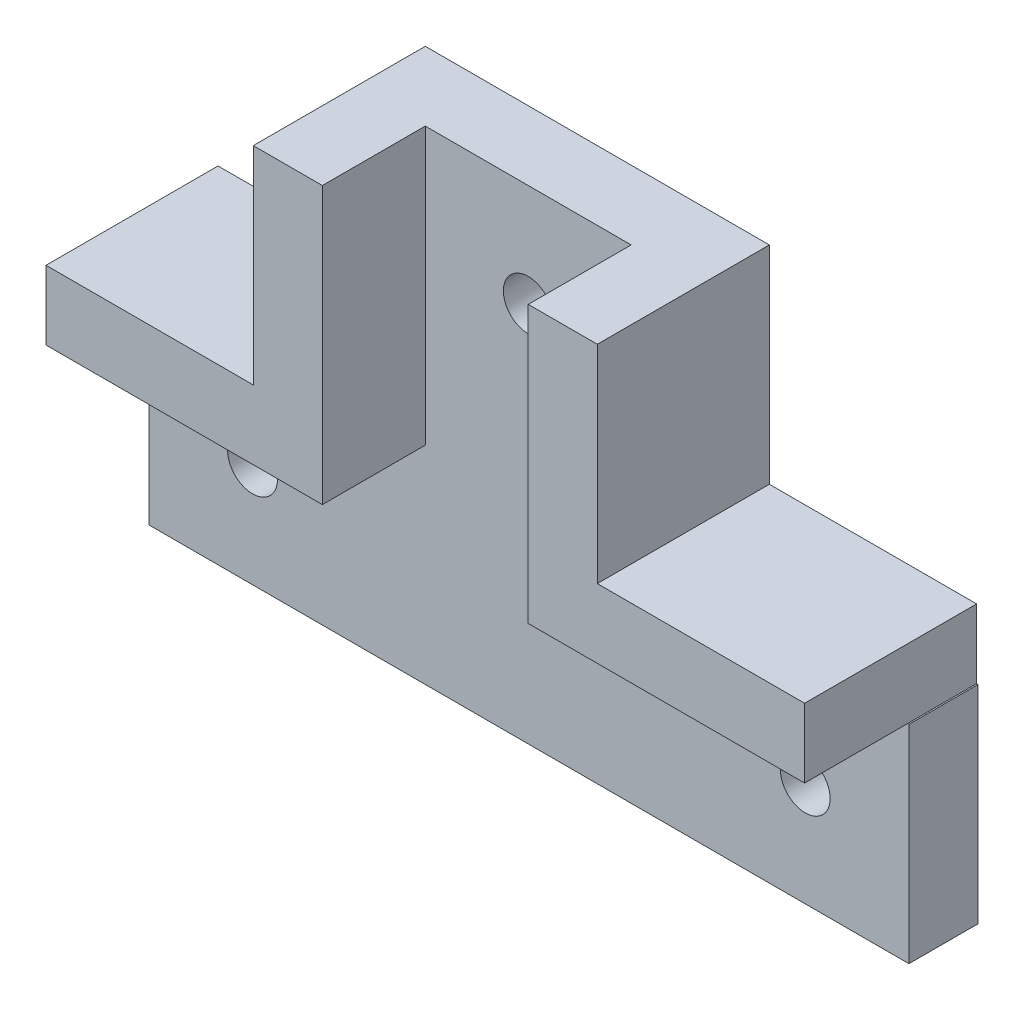
ISO-10303-21;
HEADER;
FILE_DESCRIPTION(('STEP AP214'),'2;1');
FILE_NAME('part.step','',(''),(''),'','','');
FILE_SCHEMA(('AUTOMOTIVE_DESIGN { 1 0 10303 214 1 1 1 1 }'));
ENDSEC;
DATA;
#1=APPLICATION_CONTEXT('core data for automotive mechanical design processes');
#2=APPLICATION_PROTOCOL_DEFINITION('international standard','automotive_design',2000,#1);
#3=PRODUCT_CONTEXT('',#1,'mechanical');
#4=PRODUCT('Part','Part','',(#3));
#5=PRODUCT_RELATED_PRODUCT_CATEGORY('part','',(#4));
#6=PRODUCT_DEFINITION_FORMATION('','',#4);
#7=PRODUCT_DEFINITION_CONTEXT('part definition',#1,'design');
#8=PRODUCT_DEFINITION('design','',#6,#7);
#9=PRODUCT_DEFINITION_SHAPE('','',#8);
#10=(LENGTH_UNIT() NAMED_UNIT(*) SI_UNIT(.MILLI.,.METRE.));
#11=(NAMED_UNIT(*) PLANE_ANGLE_UNIT() SI_UNIT($,.RADIAN.));
#12=(NAMED_UNIT(*) SI_UNIT($,.STERADIAN.) SOLID_ANGLE_UNIT());
#13=UNCERTAINTY_MEASURE_WITH_UNIT(LENGTH_MEASURE(1.E-05),#10,'distance_accuracy_value','');
#14=(GEOMETRIC_REPRESENTATION_CONTEXT(3) GLOBAL_UNCERTAINTY_ASSIGNED_CONTEXT((#13)) GLOBAL_UNIT_ASSIGNED_CONTEXT((#10,
#11,#12)) REPRESENTATION_CONTEXT('',''));
#15=CARTESIAN_POINT('',(0.,0.,0.));
#16=DIRECTION('',(0.,0.,1.));
#17=DIRECTION('',(1.,0.,0.));
#18=AXIS2_PLACEMENT_3D('',#15,#16,#17);
#19=CARTESIAN_POINT('',(14.3137254901961,-4.26470588235294,5.));
#20=DIRECTION('',(0.,-1.,0.));
#21=DIRECTION('',(0.,0.,-1.));
#22=AXIS2_PLACEMENT_3D('',#19,#20,#21);
#23=PLANE('',#22);
#24=DIRECTION('',(0.,0.,-1.));
#25=VECTOR('',#24,1.);
#26=CARTESIAN_POINT('',(34.2137254901961,-4.26470588235295,12.45));
#27=LINE('',#26,#25);
#28=CARTESIAN_POINT('',(34.2137254901961,-4.26470588235294,5.));
#29=VERTEX_POINT('',#28);
#30=CARTESIAN_POINT('',(34.2137254901961,-4.26470588235294,0.));
#31=VERTEX_POINT('',#30);
#32=EDGE_CURVE('E159',#29,#31,#27,.T.);
#33=ORIENTED_EDGE('',*,*,#32,.F.);
#34=DIRECTION('',(-1.,0.,0.));
#35=VECTOR('',#34,1.);
#36=CARTESIAN_POINT('',(14.3137254901961,-4.26470588235294,5.));
#37=LINE('',#36,#35);
#38=CARTESIAN_POINT('',(34.3137254901961,-4.26470588235294,5.));
#39=VERTEX_POINT('',#38);
#40=EDGE_CURVE('E288',#39,#29,#37,.T.);
#41=ORIENTED_EDGE('',*,*,#40,.F.);
#42=DIRECTION('',(0.,0.,-1.));
#43=VECTOR('',#42,1.);
#44=CARTESIAN_POINT('',(34.3137254901961,-4.26470588235294,5.));
#45=LINE('',#44,#43);
#46=CARTESIAN_POINT('',(34.3137254901961,-4.26470588235294,0.));
#47=VERTEX_POINT('',#46);
#48=EDGE_CURVE('E300',#39,#47,#45,.T.);
#49=ORIENTED_EDGE('',*,*,#48,.T.);
#50=DIRECTION('',(-1.,0.,0.));
#51=VECTOR('',#50,1.);
#52=CARTESIAN_POINT('',(14.3137254901961,-4.26470588235294,0.));
#53=LINE('',#52,#51);
#54=EDGE_CURVE('E310',#47,#31,#53,.T.);
#55=ORIENTED_EDGE('',*,*,#54,.T.);
#56=EDGE_LOOP('',(#33,#41,#49,#55));
#57=FACE_BOUND('',#56,.T.);
#58=ADVANCED_FACE('F39',(#57),#23,.F.);
#59=CARTESIAN_POINT('',(0.,0.,5.));
#60=DIRECTION('',(0.,0.,1.));
#61=DIRECTION('',(1.,0.,0.));
#62=AXIS2_PLACEMENT_3D('',#59,#60,#61);
#63=PLANE('',#62);
#64=CARTESIAN_POINT('',(6.76372549019609,8.23529411764706,5.));
#65=DIRECTION('',(0.,0.,1.));
#66=DIRECTION('',(1.,0.,0.));
#67=AXIS2_PLACEMENT_3D('',#64,#65,#66);
#68=CIRCLE('',#67,1.8);
#69=CARTESIAN_POINT('',(8.56372549019608,8.23529411764706,5.));
#70=VERTEX_POINT('',#69);
#71=EDGE_CURVE('E572',#70,#70,#68,.T.);
#72=ORIENTED_EDGE('',*,*,#71,.F.);
#73=EDGE_LOOP('',(#72));
#74=FACE_BOUND('',#73,.T.);
#75=CARTESIAN_POINT('',(-13.1862745098039,-11.7647058823529,5.));
#76=DIRECTION('',(0.,0.,1.));
#77=DIRECTION('',(1.,0.,0.));
#78=AXIS2_PLACEMENT_3D('',#75,#76,#77);
#79=CIRCLE('',#78,1.8);
#80=CARTESIAN_POINT('',(-11.3862745098039,-11.7647058823529,5.));
#81=VERTEX_POINT('',#80);
#82=EDGE_CURVE('E580',#81,#81,#79,.T.);
#83=ORIENTED_EDGE('',*,*,#82,.F.);
#84=EDGE_LOOP('',(#83));
#85=FACE_BOUND('',#84,.T.);
#86=CARTESIAN_POINT('',(26.8137254901961,-11.7647058823529,5.));
#87=DIRECTION('',(0.,0.,1.));
#88=DIRECTION('',(1.,0.,0.));
#89=AXIS2_PLACEMENT_3D('',#86,#87,#88);
#90=CIRCLE('',#89,1.8);
#91=CARTESIAN_POINT('',(28.6137254901961,-11.7647058823529,5.));
#92=VERTEX_POINT('',#91);
#93=EDGE_CURVE('E589',#92,#92,#90,.T.);
#94=ORIENTED_EDGE('',*,*,#93,.F.);
#95=EDGE_LOOP('',(#94));
#96=FACE_BOUND('',#95,.T.);
#97=DIRECTION('',(1.,0.,0.));
#98=VECTOR('',#97,1.);
#99=CARTESIAN_POINT('',(0.,-4.26470588235295,5.));
#100=LINE('',#99,#98);
#101=CARTESIAN_POINT('',(14.2137254901961,-4.26470588235295,5.));
#102=VERTEX_POINT('',#101);
#103=EDGE_CURVE('E55',#102,#29,#100,.T.);
#104=ORIENTED_EDGE('',*,*,#103,.F.);
#105=DIRECTION('',(0.,1.,0.));
#106=VECTOR('',#105,1.);
#107=CARTESIAN_POINT('',(14.2137254901961,0.,5.));
#108=LINE('',#107,#106);
#109=CARTESIAN_POINT('',(14.2137254901961,15.7352941176471,5.));
#110=VERTEX_POINT('',#109);
#111=EDGE_CURVE('E59',#102,#110,#108,.T.);
#112=ORIENTED_EDGE('',*,*,#111,.T.);
#113=DIRECTION('',(-1.,0.,0.));
#114=VECTOR('',#113,1.);
#115=CARTESIAN_POINT('',(-0.686274509803913,15.7352941176471,5.));
#116=LINE('',#115,#114);
#117=CARTESIAN_POINT('',(-0.686274509803913,15.7352941176471,5.));
#118=VERTEX_POINT('',#117);
#119=EDGE_CURVE('E291',#110,#118,#116,.T.);
#120=ORIENTED_EDGE('',*,*,#119,.T.);
#121=DIRECTION('',(0.,-1.,0.));
#122=VECTOR('',#121,1.);
#123=CARTESIAN_POINT('',(-0.686274509803913,15.7352941176471,5.));
#124=LINE('',#123,#122);
#125=CARTESIAN_POINT('',(-0.68627450980391,-4.26470588235294,5.));
#126=VERTEX_POINT('',#125);
#127=EDGE_CURVE('E294',#118,#126,#124,.T.);
#128=ORIENTED_EDGE('',*,*,#127,.T.);
#129=DIRECTION('',(-1.,0.,0.));
#130=VECTOR('',#129,1.);
#131=CARTESIAN_POINT('',(-20.6862745098039,-4.26470588235294,5.));
#132=LINE('',#131,#130);
#133=CARTESIAN_POINT('',(-20.6862745098039,-4.26470588235294,5.));
#134=VERTEX_POINT('',#133);
#135=EDGE_CURVE('E297',#126,#134,#132,.T.);
#136=ORIENTED_EDGE('',*,*,#135,.T.);
#137=DIRECTION('',(0.,-1.,0.));
#138=VECTOR('',#137,1.);
#139=CARTESIAN_POINT('',(-20.6862745098039,-4.26470588235294,5.));
#140=LINE('',#139,#138);
#141=CARTESIAN_POINT('',(-20.6862745098039,-19.2647058823529,5.));
#142=VERTEX_POINT('',#141);
#143=EDGE_CURVE('E277',#134,#142,#140,.T.);
#144=ORIENTED_EDGE('',*,*,#143,.T.);
#145=DIRECTION('',(1.,0.,0.));
#146=VECTOR('',#145,1.);
#147=CARTESIAN_POINT('',(-20.6862745098039,-19.2647058823529,5.));
#148=LINE('',#147,#146);
#149=CARTESIAN_POINT('',(34.3137254901961,-19.2647058823529,5.));
#150=VERTEX_POINT('',#149);
#151=EDGE_CURVE('E281',#142,#150,#148,.T.);
#152=ORIENTED_EDGE('',*,*,#151,.T.);
#153=DIRECTION('',(0.,1.,0.));
#154=VECTOR('',#153,1.);
#155=CARTESIAN_POINT('',(34.3137254901961,-4.26470588235294,5.));
#156=LINE('',#155,#154);
#157=EDGE_CURVE('E285',#150,#39,#156,.T.);
#158=ORIENTED_EDGE('',*,*,#157,.T.);
#159=ORIENTED_EDGE('',*,*,#40,.T.);
#160=EDGE_LOOP('',(#104,#112,#120,#128,#136,#144,#152,#158,#159));
#161=FACE_BOUND('',#160,.T.);
#162=ADVANCED_FACE('F333',(#74,#85,#96,#161),#63,.T.);
#163=CARTESIAN_POINT('',(-20.6862745098039,-4.26470588235294,5.));
#164=DIRECTION('',(1.,0.,0.));
#165=DIRECTION('',(0.,1.,0.));
#166=AXIS2_PLACEMENT_3D('',#163,#164,#165);
#167=PLANE('',#166);
#168=DIRECTION('',(0.,-1.,0.));
#169=VECTOR('',#168,1.);
#170=CARTESIAN_POINT('',(-20.6862745098039,-4.26470588235294,0.));
#171=LINE('',#170,#169);
#172=CARTESIAN_POINT('',(-20.6862745098039,0.735294117647059,0.));
#173=VERTEX_POINT('',#172);
#174=CARTESIAN_POINT('',(-20.6862745098039,-19.2647058823529,0.));
#175=VERTEX_POINT('',#174);
#176=EDGE_CURVE('E258',#173,#175,#171,.T.);
#177=ORIENTED_EDGE('',*,*,#176,.T.);
#178=DIRECTION('',(0.,0.,-1.));
#179=VECTOR('',#178,1.);
#180=CARTESIAN_POINT('',(-20.6862745098039,-19.2647058823529,5.));
#181=LINE('',#180,#179);
#182=EDGE_CURVE('E11',#142,#175,#181,.T.);
#183=ORIENTED_EDGE('',*,*,#182,.F.);
#184=ORIENTED_EDGE('',*,*,#143,.F.);
#185=DIRECTION('',(0.,0.,-1.));
#186=VECTOR('',#185,1.);
#187=CARTESIAN_POINT('',(-20.6862745098039,-4.26470588235294,12.45));
#188=LINE('',#187,#186);
#189=CARTESIAN_POINT('',(-20.6862745098039,-4.26470588235294,12.45));
#190=VERTEX_POINT('',#189);
#191=EDGE_CURVE('E254',#190,#134,#188,.T.);
#192=ORIENTED_EDGE('',*,*,#191,.F.);
#193=DIRECTION('',(0.,1.,0.));
#194=VECTOR('',#193,1.);
#195=CARTESIAN_POINT('',(-20.6862745098039,-4.26470588235294,12.45));
#196=LINE('',#195,#194);
#197=CARTESIAN_POINT('',(-20.6862745098039,0.735294117647059,12.45));
#198=VERTEX_POINT('',#197);
#199=EDGE_CURVE('E225',#190,#198,#196,.T.);
#200=ORIENTED_EDGE('',*,*,#199,.T.);
#201=DIRECTION('',(0.,0.,-1.));
#202=VECTOR('',#201,1.);
#203=CARTESIAN_POINT('',(-20.6862745098039,0.735294117647059,12.45));
#204=LINE('',#203,#202);
#205=EDGE_CURVE('E247',#198,#173,#204,.T.);
#206=ORIENTED_EDGE('',*,*,#205,.T.);
#207=EDGE_LOOP('',(#177,#183,#184,#192,#200,#206));
#208=FACE_BOUND('',#207,.T.);
#209=ADVANCED_FACE('F41',(#208),#167,.F.);
#210=CARTESIAN_POINT('',(-20.6862745098039,-19.2647058823529,5.));
#211=DIRECTION('',(0.,1.,0.));
#212=DIRECTION('',(0.,0.,1.));
#213=AXIS2_PLACEMENT_3D('',#210,#211,#212);
#214=PLANE('',#213);
#215=DIRECTION('',(1.,0.,0.));
#216=VECTOR('',#215,1.);
#217=CARTESIAN_POINT('',(-20.6862745098039,-19.2647058823529,0.));
#218=LINE('',#217,#216);
#219=CARTESIAN_POINT('',(34.3137254901961,-19.2647058823529,0.));
#220=VERTEX_POINT('',#219);
#221=EDGE_CURVE('E304',#175,#220,#218,.T.);
#222=ORIENTED_EDGE('',*,*,#221,.T.);
#223=DIRECTION('',(0.,0.,-1.));
#224=VECTOR('',#223,1.);
#225=CARTESIAN_POINT('',(34.3137254901961,-19.2647058823529,5.));
#226=LINE('',#225,#224);
#227=EDGE_CURVE('E48',#150,#220,#226,.T.);
#228=ORIENTED_EDGE('',*,*,#227,.F.);
#229=ORIENTED_EDGE('',*,*,#151,.F.);
#230=ORIENTED_EDGE('',*,*,#182,.T.);
#231=EDGE_LOOP('',(#222,#228,#229,#230));
#232=FACE_BOUND('',#231,.T.);
#233=ADVANCED_FACE('F336',(#232),#214,.F.);
#234=CARTESIAN_POINT('',(34.3137254901961,-4.26470588235294,5.));
#235=DIRECTION('',(-1.,0.,0.));
#236=DIRECTION('',(0.,-1.,0.));
#237=AXIS2_PLACEMENT_3D('',#234,#235,#236);
#238=PLANE('',#237);
#239=DIRECTION('',(0.,1.,0.));
#240=VECTOR('',#239,1.);
#241=CARTESIAN_POINT('',(34.3137254901961,-4.26470588235294,0.));
#242=LINE('',#241,#240);
#243=EDGE_CURVE('E307',#220,#47,#242,.T.);
#244=ORIENTED_EDGE('',*,*,#243,.T.);
#245=ORIENTED_EDGE('',*,*,#48,.F.);
#246=ORIENTED_EDGE('',*,*,#157,.F.);
#247=ORIENTED_EDGE('',*,*,#227,.T.);
#248=EDGE_LOOP('',(#244,#245,#246,#247));
#249=FACE_BOUND('',#248,.T.);
#250=ADVANCED_FACE('F323',(#249),#238,.F.);
#251=CARTESIAN_POINT('',(-0.686274509803913,15.7352941176471,5.));
#252=DIRECTION('',(0.,-1.,0.));
#253=DIRECTION('',(0.,0.,-1.));
#254=AXIS2_PLACEMENT_3D('',#251,#252,#253);
#255=PLANE('',#254);
#256=DIRECTION('',(0.,0.,-1.));
#257=VECTOR('',#256,1.);
#258=CARTESIAN_POINT('',(19.2137254901961,15.7352941176471,12.45));
#259=LINE('',#258,#257);
#260=CARTESIAN_POINT('',(19.2137254901961,15.7352941176471,12.45));
#261=VERTEX_POINT('',#260);
#262=CARTESIAN_POINT('',(19.2137254901961,15.7352941176471,0.));
#263=VERTEX_POINT('',#262);
#264=EDGE_CURVE('E210',#261,#263,#259,.T.);
#265=ORIENTED_EDGE('',*,*,#264,.T.);
#266=DIRECTION('',(-1.,0.,0.));
#267=VECTOR('',#266,1.);
#268=CARTESIAN_POINT('',(-0.686274509803913,15.7352941176471,0.));
#269=LINE('',#268,#267);
#270=CARTESIAN_POINT('',(-5.68627450980391,15.7352941176471,0.));
#271=VERTEX_POINT('',#270);
#272=EDGE_CURVE('E282',#263,#271,#269,.T.);
#273=ORIENTED_EDGE('',*,*,#272,.T.);
#274=DIRECTION('',(0.,0.,-1.));
#275=VECTOR('',#274,1.);
#276=CARTESIAN_POINT('',(-5.68627450980391,15.7352941176471,12.45));
#277=LINE('',#276,#275);
#278=CARTESIAN_POINT('',(-5.68627450980391,15.7352941176471,12.45));
#279=VERTEX_POINT('',#278);
#280=EDGE_CURVE('E267',#279,#271,#277,.T.);
#281=ORIENTED_EDGE('',*,*,#280,.F.);
#282=DIRECTION('',(-1.,0.,0.));
#283=VECTOR('',#282,1.);
#284=CARTESIAN_POINT('',(-0.686274509803913,15.7352941176471,12.45));
#285=LINE('',#284,#283);
#286=CARTESIAN_POINT('',(-0.686274509803913,15.7352941176471,12.45));
#287=VERTEX_POINT('',#286);
#288=EDGE_CURVE('E237',#287,#279,#285,.T.);
#289=ORIENTED_EDGE('',*,*,#288,.F.);
#290=DIRECTION('',(0.,0.,-1.));
#291=VECTOR('',#290,1.);
#292=CARTESIAN_POINT('',(-0.686274509803913,15.7352941176471,12.45));
#293=LINE('',#292,#291);
#294=EDGE_CURVE('E263',#287,#118,#293,.T.);
#295=ORIENTED_EDGE('',*,*,#294,.T.);
#296=ORIENTED_EDGE('',*,*,#119,.F.);
#297=DIRECTION('',(0.,0.,-1.));
#298=VECTOR('',#297,1.);
#299=CARTESIAN_POINT('',(14.2137254901961,15.7352941176471,12.45));
#300=LINE('',#299,#298);
#301=CARTESIAN_POINT('',(14.2137254901961,15.7352941176471,12.45));
#302=VERTEX_POINT('',#301);
#303=EDGE_CURVE('E214',#302,#110,#300,.T.);
#304=ORIENTED_EDGE('',*,*,#303,.F.);
#305=DIRECTION('',(1.,0.,0.));
#306=VECTOR('',#305,1.);
#307=CARTESIAN_POINT('',(14.2137254901961,15.7352941176471,12.45));
#308=LINE('',#307,#306);
#309=EDGE_CURVE('E180',#302,#261,#308,.T.);
#310=ORIENTED_EDGE('',*,*,#309,.T.);
#311=EDGE_LOOP('',(#265,#273,#281,#289,#295,#296,#304,#310));
#312=FACE_BOUND('',#311,.T.);
#313=ADVANCED_FACE('F350',(#312),#255,.F.);
#314=CARTESIAN_POINT('',(0.,0.,0.));
#315=DIRECTION('',(0.,0.,1.));
#316=DIRECTION('',(1.,0.,0.));
#317=AXIS2_PLACEMENT_3D('',#314,#315,#316);
#318=PLANE('',#317);
#319=CARTESIAN_POINT('',(6.76372549019609,8.23529411764706,0.));
#320=DIRECTION('',(0.,0.,1.));
#321=DIRECTION('',(1.,0.,0.));
#322=AXIS2_PLACEMENT_3D('',#319,#320,#321);
#323=CIRCLE('',#322,1.8);
#324=CARTESIAN_POINT('',(8.56372549019608,8.23529411764706,0.));
#325=VERTEX_POINT('',#324);
#326=EDGE_CURVE('E198',#325,#325,#323,.T.);
#327=ORIENTED_EDGE('',*,*,#326,.T.);
#328=EDGE_LOOP('',(#327));
#329=FACE_BOUND('',#328,.T.);
#330=CARTESIAN_POINT('',(-13.1862745098039,-11.7647058823529,0.));
#331=DIRECTION('',(0.,0.,1.));
#332=DIRECTION('',(1.,0.,0.));
#333=AXIS2_PLACEMENT_3D('',#330,#331,#332);
#334=CIRCLE('',#333,1.8);
#335=CARTESIAN_POINT('',(-11.3862745098039,-11.7647058823529,0.));
#336=VERTEX_POINT('',#335);
#337=EDGE_CURVE('E574',#336,#336,#334,.T.);
#338=ORIENTED_EDGE('',*,*,#337,.T.);
#339=EDGE_LOOP('',(#338));
#340=FACE_BOUND('',#339,.T.);
#341=CARTESIAN_POINT('',(26.8137254901961,-11.7647058823529,0.));
#342=DIRECTION('',(0.,0.,1.));
#343=DIRECTION('',(1.,0.,0.));
#344=AXIS2_PLACEMENT_3D('',#341,#342,#343);
#345=CIRCLE('',#344,1.8);
#346=CARTESIAN_POINT('',(28.6137254901961,-11.7647058823529,0.));
#347=VERTEX_POINT('',#346);
#348=EDGE_CURVE('E586',#347,#347,#345,.T.);
#349=ORIENTED_EDGE('',*,*,#348,.T.);
#350=EDGE_LOOP('',(#349));
#351=FACE_BOUND('',#350,.T.);
#352=ORIENTED_EDGE('',*,*,#272,.F.);
#353=DIRECTION('',(0.,-1.,0.));
#354=VECTOR('',#353,1.);
#355=CARTESIAN_POINT('',(19.2137254901961,15.7352941176471,0.));
#356=LINE('',#355,#354);
#357=CARTESIAN_POINT('',(19.2137254901961,0.735294117647055,0.));
#358=VERTEX_POINT('',#357);
#359=EDGE_CURVE('E197',#263,#358,#356,.T.);
#360=ORIENTED_EDGE('',*,*,#359,.T.);
#361=DIRECTION('',(-1.,0.,0.));
#362=VECTOR('',#361,1.);
#363=CARTESIAN_POINT('',(34.2137254901961,0.735294117647054,0.));
#364=LINE('',#363,#362);
#365=CARTESIAN_POINT('',(34.2137254901961,0.735294117647054,0.));
#366=VERTEX_POINT('',#365);
#367=EDGE_CURVE('E170',#366,#358,#364,.T.);
#368=ORIENTED_EDGE('',*,*,#367,.F.);
#369=DIRECTION('',(0.,1.,0.));
#370=VECTOR('',#369,1.);
#371=CARTESIAN_POINT('',(34.2137254901961,-4.26470588235295,0.));
#372=LINE('',#371,#370);
#373=EDGE_CURVE('E194',#31,#366,#372,.T.);
#374=ORIENTED_EDGE('',*,*,#373,.F.);
#375=ORIENTED_EDGE('',*,*,#54,.F.);
#376=ORIENTED_EDGE('',*,*,#243,.F.);
#377=ORIENTED_EDGE('',*,*,#221,.F.);
#378=ORIENTED_EDGE('',*,*,#176,.F.);
#379=DIRECTION('',(1.,0.,0.));
#380=VECTOR('',#379,1.);
#381=CARTESIAN_POINT('',(-6.07997052750672,0.735294117647057,0.));
#382=LINE('',#381,#380);
#383=CARTESIAN_POINT('',(-5.68627450980391,0.735294117647057,0.));
#384=VERTEX_POINT('',#383);
#385=EDGE_CURVE('E224',#173,#384,#382,.T.);
#386=ORIENTED_EDGE('',*,*,#385,.T.);
#387=DIRECTION('',(0.,-1.,0.));
#388=VECTOR('',#387,1.);
#389=CARTESIAN_POINT('',(-5.68627450980391,15.7352941176471,0.));
#390=LINE('',#389,#388);
#391=EDGE_CURVE('E230',#271,#384,#390,.T.);
#392=ORIENTED_EDGE('',*,*,#391,.F.);
#393=EDGE_LOOP('',(#352,#360,#368,#374,#375,#376,#377,#378,#386,#392));
#394=FACE_BOUND('',#393,.T.);
#395=ADVANCED_FACE('F328',(#329,#340,#351,#394),#318,.F.);
#396=CARTESIAN_POINT('',(-20.6862745098039,-4.26470588235294,12.45));
#397=DIRECTION('',(0.,1.,0.));
#398=DIRECTION('',(-1.,0.,0.));
#399=AXIS2_PLACEMENT_3D('',#396,#397,#398);
#400=PLANE('',#399);
#401=ORIENTED_EDGE('',*,*,#135,.F.);
#402=DIRECTION('',(0.,0.,-1.));
#403=VECTOR('',#402,1.);
#404=CARTESIAN_POINT('',(-0.686274509803916,-4.26470588235294,12.45));
#405=LINE('',#404,#403);
#406=CARTESIAN_POINT('',(-0.686274509803916,-4.26470588235294,12.45));
#407=VERTEX_POINT('',#406);
#408=EDGE_CURVE('E259',#407,#126,#405,.T.);
#409=ORIENTED_EDGE('',*,*,#408,.F.);
#410=DIRECTION('',(1.,0.,0.));
#411=VECTOR('',#410,1.);
#412=CARTESIAN_POINT('',(-20.6862745098039,-4.26470588235294,12.45));
#413=LINE('',#412,#411);
#414=EDGE_CURVE('E244',#190,#407,#413,.T.);
#415=ORIENTED_EDGE('',*,*,#414,.F.);
#416=ORIENTED_EDGE('',*,*,#191,.T.);
#417=EDGE_LOOP('',(#401,#409,#415,#416));
#418=FACE_BOUND('',#417,.T.);
#419=ADVANCED_FACE('F407',(#418),#400,.F.);
#420=CARTESIAN_POINT('',(-0.686274509803913,15.7352941176471,12.45));
#421=DIRECTION('',(1.,0.,0.));
#422=DIRECTION('',(0.,1.,0.));
#423=AXIS2_PLACEMENT_3D('',#420,#421,#422);
#424=PLANE('',#423);
#425=ORIENTED_EDGE('',*,*,#408,.T.);
#426=ORIENTED_EDGE('',*,*,#127,.F.);
#427=ORIENTED_EDGE('',*,*,#294,.F.);
#428=DIRECTION('',(0.,-1.,0.));
#429=VECTOR('',#428,1.);
#430=CARTESIAN_POINT('',(-0.686274509803913,15.7352941176471,12.45));
#431=LINE('',#430,#429);
#432=EDGE_CURVE('E240',#287,#407,#431,.T.);
#433=ORIENTED_EDGE('',*,*,#432,.T.);
#434=EDGE_LOOP('',(#425,#426,#427,#433));
#435=FACE_BOUND('',#434,.T.);
#436=ADVANCED_FACE('F460',(#435),#424,.T.);
#437=CARTESIAN_POINT('',(-5.68627450980391,15.7352941176471,12.45));
#438=DIRECTION('',(1.,0.,0.));
#439=DIRECTION('',(0.,1.,0.));
#440=AXIS2_PLACEMENT_3D('',#437,#438,#439);
#441=PLANE('',#440);
#442=ORIENTED_EDGE('',*,*,#391,.T.);
#443=DIRECTION('',(0.,0.,-1.));
#444=VECTOR('',#443,1.);
#445=CARTESIAN_POINT('',(-5.68627450980391,0.735294117647057,12.45));
#446=LINE('',#445,#444);
#447=CARTESIAN_POINT('',(-5.68627450980391,0.735294117647057,12.45));
#448=VERTEX_POINT('',#447);
#449=EDGE_CURVE('E271',#448,#384,#446,.T.);
#450=ORIENTED_EDGE('',*,*,#449,.F.);
#451=DIRECTION('',(0.,-1.,0.));
#452=VECTOR('',#451,1.);
#453=CARTESIAN_POINT('',(-5.68627450980391,15.7352941176471,12.45));
#454=LINE('',#453,#452);
#455=EDGE_CURVE('E233',#279,#448,#454,.T.);
#456=ORIENTED_EDGE('',*,*,#455,.F.);
#457=ORIENTED_EDGE('',*,*,#280,.T.);
#458=EDGE_LOOP('',(#442,#450,#456,#457));
#459=FACE_BOUND('',#458,.T.);
#460=ADVANCED_FACE('F346',(#459),#441,.F.);
#461=CARTESIAN_POINT('',(-6.07997052750672,0.735294117647057,12.45));
#462=DIRECTION('',(0.,1.,0.));
#463=DIRECTION('',(0.,0.,1.));
#464=AXIS2_PLACEMENT_3D('',#461,#462,#463);
#465=PLANE('',#464);
#466=ORIENTED_EDGE('',*,*,#385,.F.);
#467=ORIENTED_EDGE('',*,*,#205,.F.);
#468=DIRECTION('',(1.,0.,0.));
#469=VECTOR('',#468,1.);
#470=CARTESIAN_POINT('',(-20.6862745098039,0.735294117647059,12.45));
#471=LINE('',#470,#469);
#472=EDGE_CURVE('E229',#198,#448,#471,.T.);
#473=ORIENTED_EDGE('',*,*,#472,.T.);
#474=ORIENTED_EDGE('',*,*,#449,.T.);
#475=EDGE_LOOP('',(#466,#467,#473,#474));
#476=FACE_BOUND('',#475,.T.);
#477=ADVANCED_FACE('F341',(#476),#465,.T.);
#478=CARTESIAN_POINT('',(0.,0.,12.45));
#479=DIRECTION('',(0.,0.,-1.));
#480=DIRECTION('',(-1.,0.,0.));
#481=AXIS2_PLACEMENT_3D('',#478,#479,#480);
#482=PLANE('',#481);
#483=ORIENTED_EDGE('',*,*,#199,.F.);
#484=ORIENTED_EDGE('',*,*,#414,.T.);
#485=ORIENTED_EDGE('',*,*,#432,.F.);
#486=ORIENTED_EDGE('',*,*,#288,.T.);
#487=ORIENTED_EDGE('',*,*,#455,.T.);
#488=ORIENTED_EDGE('',*,*,#472,.F.);
#489=EDGE_LOOP('',(#483,#484,#485,#486,#487,#488));
#490=FACE_BOUND('',#489,.T.);
#491=ADVANCED_FACE('F365',(#490),#482,.F.);
#492=CARTESIAN_POINT('',(34.2137254901961,-4.26470588235295,12.45));
#493=DIRECTION('',(-1.,0.,0.));
#494=DIRECTION('',(0.,-1.,0.));
#495=AXIS2_PLACEMENT_3D('',#492,#493,#494);
#496=PLANE('',#495);
#497=ORIENTED_EDGE('',*,*,#373,.T.);
#498=DIRECTION('',(0.,0.,-1.));
#499=VECTOR('',#498,1.);
#500=CARTESIAN_POINT('',(34.2137254901961,0.735294117647054,12.45));
#501=LINE('',#500,#499);
#502=CARTESIAN_POINT('',(34.2137254901961,0.735294117647054,12.45));
#503=VERTEX_POINT('',#502);
#504=EDGE_CURVE('E167',#503,#366,#501,.T.);
#505=ORIENTED_EDGE('',*,*,#504,.F.);
#506=DIRECTION('',(0.,1.,0.));
#507=VECTOR('',#506,1.);
#508=CARTESIAN_POINT('',(34.2137254901961,-4.26470588235295,12.45));
#509=LINE('',#508,#507);
#510=CARTESIAN_POINT('',(34.2137254901961,-4.26470588235295,12.45));
#511=VERTEX_POINT('',#510);
#512=EDGE_CURVE('E163',#511,#503,#509,.T.);
#513=ORIENTED_EDGE('',*,*,#512,.F.);
#514=EDGE_CURVE('E148',#511,#29,#27,.T.);
#515=ORIENTED_EDGE('',*,*,#514,.T.);
#516=ORIENTED_EDGE('',*,*,#32,.T.);
#517=EDGE_LOOP('',(#497,#505,#513,#515,#516));
#518=FACE_BOUND('',#517,.T.);
#519=ADVANCED_FACE('F165',(#518),#496,.F.);
#520=CARTESIAN_POINT('',(34.2137254901961,0.735294117647054,12.45));
#521=DIRECTION('',(0.,-1.,0.));
#522=DIRECTION('',(1.,0.,0.));
#523=AXIS2_PLACEMENT_3D('',#520,#521,#522);
#524=PLANE('',#523);
#525=ORIENTED_EDGE('',*,*,#367,.T.);
#526=DIRECTION('',(0.,0.,-1.));
#527=VECTOR('',#526,1.);
#528=CARTESIAN_POINT('',(19.2137254901961,0.735294117647055,12.45));
#529=LINE('',#528,#527);
#530=CARTESIAN_POINT('',(19.2137254901961,0.735294117647055,12.45));
#531=VERTEX_POINT('',#530);
#532=EDGE_CURVE('E206',#531,#358,#529,.T.);
#533=ORIENTED_EDGE('',*,*,#532,.F.);
#534=DIRECTION('',(-1.,0.,0.));
#535=VECTOR('',#534,1.);
#536=CARTESIAN_POINT('',(19.6074215078989,0.735294117647055,12.45));
#537=LINE('',#536,#535);
#538=EDGE_CURVE('E191',#503,#531,#537,.T.);
#539=ORIENTED_EDGE('',*,*,#538,.F.);
#540=ORIENTED_EDGE('',*,*,#504,.T.);
#541=EDGE_LOOP('',(#525,#533,#539,#540));
#542=FACE_BOUND('',#541,.T.);
#543=ADVANCED_FACE('F356',(#542),#524,.F.);
#544=CARTESIAN_POINT('',(19.2137254901961,15.7352941176471,12.45));
#545=DIRECTION('',(1.,0.,0.));
#546=DIRECTION('',(0.,1.,0.));
#547=AXIS2_PLACEMENT_3D('',#544,#545,#546);
#548=PLANE('',#547);
#549=ORIENTED_EDGE('',*,*,#359,.F.);
#550=ORIENTED_EDGE('',*,*,#264,.F.);
#551=DIRECTION('',(0.,-1.,0.));
#552=VECTOR('',#551,1.);
#553=CARTESIAN_POINT('',(19.2137254901961,15.7352941176471,12.45));
#554=LINE('',#553,#552);
#555=EDGE_CURVE('E187',#261,#531,#554,.T.);
#556=ORIENTED_EDGE('',*,*,#555,.T.);
#557=ORIENTED_EDGE('',*,*,#532,.T.);
#558=EDGE_LOOP('',(#549,#550,#556,#557));
#559=FACE_BOUND('',#558,.T.);
#560=ADVANCED_FACE('F353',(#559),#548,.T.);
#561=CARTESIAN_POINT('',(14.2137254901961,15.7352941176471,12.45));
#562=DIRECTION('',(1.,0.,0.));
#563=DIRECTION('',(0.,1.,0.));
#564=AXIS2_PLACEMENT_3D('',#561,#562,#563);
#565=PLANE('',#564);
#566=ORIENTED_EDGE('',*,*,#111,.F.);
#567=DIRECTION('',(0.,0.,-1.));
#568=VECTOR('',#567,1.);
#569=CARTESIAN_POINT('',(14.2137254901961,-4.26470588235295,12.45));
#570=LINE('',#569,#568);
#571=CARTESIAN_POINT('',(14.2137254901961,-4.26470588235295,12.45));
#572=VERTEX_POINT('',#571);
#573=EDGE_CURVE('E158',#572,#102,#570,.T.);
#574=ORIENTED_EDGE('',*,*,#573,.F.);
#575=DIRECTION('',(0.,-1.,0.));
#576=VECTOR('',#575,1.);
#577=CARTESIAN_POINT('',(14.2137254901961,15.7352941176471,12.45));
#578=LINE('',#577,#576);
#579=EDGE_CURVE('E175',#302,#572,#578,.T.);
#580=ORIENTED_EDGE('',*,*,#579,.F.);
#581=ORIENTED_EDGE('',*,*,#303,.T.);
#582=EDGE_LOOP('',(#566,#574,#580,#581));
#583=FACE_BOUND('',#582,.T.);
#584=ADVANCED_FACE('F363',(#583),#565,.F.);
#585=CARTESIAN_POINT('',(34.2137254901961,-4.26470588235295,12.45));
#586=DIRECTION('',(0.,-1.,0.));
#587=DIRECTION('',(1.,0.,0.));
#588=AXIS2_PLACEMENT_3D('',#585,#586,#587);
#589=PLANE('',#588);
#590=ORIENTED_EDGE('',*,*,#573,.T.);
#591=ORIENTED_EDGE('',*,*,#103,.T.);
#592=ORIENTED_EDGE('',*,*,#514,.F.);
#593=DIRECTION('',(-1.,0.,0.));
#594=VECTOR('',#593,1.);
#595=CARTESIAN_POINT('',(34.2137254901961,-4.26470588235295,12.45));
#596=LINE('',#595,#594);
#597=EDGE_CURVE('E153',#511,#572,#596,.T.);
#598=ORIENTED_EDGE('',*,*,#597,.T.);
#599=EDGE_LOOP('',(#590,#591,#592,#598));
#600=FACE_BOUND('',#599,.T.);
#601=ADVANCED_FACE('F151',(#600),#589,.T.);
#602=CARTESIAN_POINT('',(13.5274509803922,0.,12.45));
#603=DIRECTION('',(0.,0.,-1.));
#604=DIRECTION('',(1.,0.,0.));
#605=AXIS2_PLACEMENT_3D('',#602,#603,#604);
#606=PLANE('',#605);
#607=ORIENTED_EDGE('',*,*,#512,.T.);
#608=ORIENTED_EDGE('',*,*,#538,.T.);
#609=ORIENTED_EDGE('',*,*,#555,.F.);
#610=ORIENTED_EDGE('',*,*,#309,.F.);
#611=ORIENTED_EDGE('',*,*,#579,.T.);
#612=ORIENTED_EDGE('',*,*,#597,.F.);
#613=EDGE_LOOP('',(#607,#608,#609,#610,#611,#612));
#614=FACE_BOUND('',#613,.T.);
#615=ADVANCED_FACE('F172',(#614),#606,.F.);
#616=CARTESIAN_POINT('',(26.8137254901961,-11.7647058823529,0.));
#617=DIRECTION('',(0.,0.,1.));
#618=DIRECTION('',(1.,0.,0.));
#619=AXIS2_PLACEMENT_3D('',#616,#617,#618);
#620=CYLINDRICAL_SURFACE('',#619,1.8);
#621=ORIENTED_EDGE('',*,*,#348,.F.);
#622=EDGE_LOOP('',(#621));
#623=FACE_BOUND('',#622,.T.);
#624=ORIENTED_EDGE('',*,*,#93,.T.);
#625=EDGE_LOOP('',(#624));
#626=FACE_BOUND('',#625,.T.);
#627=ADVANCED_FACE('F417',(#623,#626),#620,.F.);
#628=CARTESIAN_POINT('',(-13.1862745098039,-11.7647058823529,0.));
#629=DIRECTION('',(0.,0.,1.));
#630=DIRECTION('',(1.,0.,0.));
#631=AXIS2_PLACEMENT_3D('',#628,#629,#630);
#632=CYLINDRICAL_SURFACE('',#631,1.8);
#633=ORIENTED_EDGE('',*,*,#337,.F.);
#634=EDGE_LOOP('',(#633));
#635=FACE_BOUND('',#634,.T.);
#636=ORIENTED_EDGE('',*,*,#82,.T.);
#637=EDGE_LOOP('',(#636));
#638=FACE_BOUND('',#637,.T.);
#639=ADVANCED_FACE('F422',(#635,#638),#632,.F.);
#640=CARTESIAN_POINT('',(6.76372549019609,8.23529411764706,0.));
#641=DIRECTION('',(0.,0.,1.));
#642=DIRECTION('',(1.,0.,0.));
#643=AXIS2_PLACEMENT_3D('',#640,#641,#642);
#644=CYLINDRICAL_SURFACE('',#643,1.8);
#645=ORIENTED_EDGE('',*,*,#326,.F.);
#646=EDGE_LOOP('',(#645));
#647=FACE_BOUND('',#646,.T.);
#648=ORIENTED_EDGE('',*,*,#71,.T.);
#649=EDGE_LOOP('',(#648));
#650=FACE_BOUND('',#649,.T.);
#651=ADVANCED_FACE('F432',(#647,#650),#644,.F.);
#652=CLOSED_SHELL('',(#58,#162,#209,#233,#250,#313,#395,#419,#436,#460,#477,#491,#519,#543,#560,
#584,#601,#615,#627,#639,#651));
#653=MANIFOLD_SOLID_BREP('B2',#652);
#654=ADVANCED_BREP_SHAPE_REPRESENTATION('',(#18,#653),#14);
#655=SHAPE_DEFINITION_REPRESENTATION(#9,#654);
ENDSEC;
END-ISO-10303-21;
